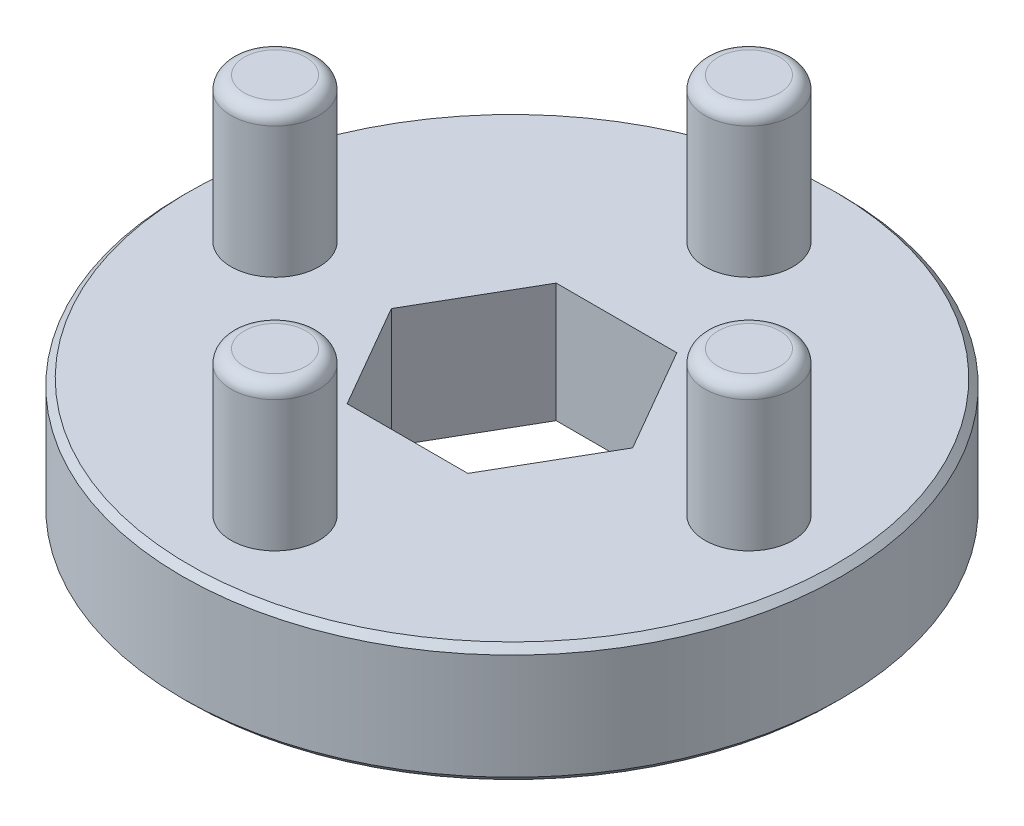
ISO-10303-21;
HEADER;
FILE_DESCRIPTION(('STEP AP214'),'2;1');
FILE_NAME('part.step','',(''),(''),'','','');
FILE_SCHEMA(('AUTOMOTIVE_DESIGN { 1 0 10303 214 1 1 1 1 }'));
ENDSEC;
DATA;
#1=APPLICATION_CONTEXT('core data for automotive mechanical design processes');
#2=APPLICATION_PROTOCOL_DEFINITION('international standard','automotive_design',2000,#1);
#3=PRODUCT_CONTEXT('',#1,'mechanical');
#4=PRODUCT('Part','Part','',(#3));
#5=PRODUCT_RELATED_PRODUCT_CATEGORY('part','',(#4));
#6=PRODUCT_DEFINITION_FORMATION('','',#4);
#7=PRODUCT_DEFINITION_CONTEXT('part definition',#1,'design');
#8=PRODUCT_DEFINITION('design','',#6,#7);
#9=PRODUCT_DEFINITION_SHAPE('','',#8);
#10=(LENGTH_UNIT() NAMED_UNIT(*) SI_UNIT(.MILLI.,.METRE.));
#11=(NAMED_UNIT(*) PLANE_ANGLE_UNIT() SI_UNIT($,.RADIAN.));
#12=(NAMED_UNIT(*) SI_UNIT($,.STERADIAN.) SOLID_ANGLE_UNIT());
#13=UNCERTAINTY_MEASURE_WITH_UNIT(LENGTH_MEASURE(1.E-05),#10,'distance_accuracy_value','');
#14=(GEOMETRIC_REPRESENTATION_CONTEXT(3) GLOBAL_UNCERTAINTY_ASSIGNED_CONTEXT((#13)) GLOBAL_UNIT_ASSIGNED_CONTEXT((#10,
#11,#12)) REPRESENTATION_CONTEXT('',''));
#15=CARTESIAN_POINT('',(0.,0.,0.));
#16=DIRECTION('',(0.,0.,1.));
#17=DIRECTION('',(1.,0.,0.));
#18=AXIS2_PLACEMENT_3D('',#15,#16,#17);
#19=CARTESIAN_POINT('',(-9.,10.000000066,0.));
#20=DIRECTION('',(0.,1.,0.));
#21=DIRECTION('',(0.,0.,1.));
#22=AXIS2_PLACEMENT_3D('',#19,#20,#21);
#23=PLANE('',#22);
#24=CARTESIAN_POINT('',(-9.,10.000000066,0.));
#25=DIRECTION('',(0.,-1.,0.));
#26=DIRECTION('',(0.,0.,-1.));
#27=AXIS2_PLACEMENT_3D('',#24,#25,#26);
#28=CIRCLE('',#27,1.17);
#29=CARTESIAN_POINT('',(-9.,10.000000066,-1.17000000000009));
#30=VERTEX_POINT('',#29);
#31=CARTESIAN_POINT('',(-9.,10.000000066,1.16999999999991));
#32=VERTEX_POINT('',#31);
#33=EDGE_CURVE('E94',#30,#32,#28,.T.);
#34=ORIENTED_EDGE('',*,*,#33,.F.);
#35=CARTESIAN_POINT('',(-9.,10.000000066,0.));
#36=DIRECTION('',(0.,-1.,0.));
#37=DIRECTION('',(0.,0.,1.));
#38=AXIS2_PLACEMENT_3D('',#35,#36,#37);
#39=CIRCLE('',#38,1.17);
#40=EDGE_CURVE('E92',#32,#30,#39,.T.);
#41=ORIENTED_EDGE('',*,*,#40,.F.);
#42=EDGE_LOOP('',(#34,#41));
#43=FACE_BOUND('',#42,.T.);
#44=ADVANCED_FACE('F16',(#43),#23,.T.);
#45=CARTESIAN_POINT('',(0.,10.000000066,9.));
#46=DIRECTION('',(0.,1.,0.));
#47=DIRECTION('',(0.,0.,1.));
#48=AXIS2_PLACEMENT_3D('',#45,#46,#47);
#49=PLANE('',#48);
#50=CARTESIAN_POINT('',(0.,10.000000066,9.));
#51=DIRECTION('',(0.,-1.,0.));
#52=DIRECTION('',(0.,0.,-1.));
#53=AXIS2_PLACEMENT_3D('',#50,#51,#52);
#54=CIRCLE('',#53,1.17);
#55=CARTESIAN_POINT('',(0.,10.000000066,7.83));
#56=VERTEX_POINT('',#55);
#57=CARTESIAN_POINT('',(0.,10.000000066,10.17));
#58=VERTEX_POINT('',#57);
#59=EDGE_CURVE('E338',#56,#58,#54,.T.);
#60=ORIENTED_EDGE('',*,*,#59,.F.);
#61=CARTESIAN_POINT('',(0.,10.000000066,9.));
#62=DIRECTION('',(0.,-1.,0.));
#63=DIRECTION('',(0.,0.,1.));
#64=AXIS2_PLACEMENT_3D('',#61,#62,#63);
#65=CIRCLE('',#64,1.17);
#66=EDGE_CURVE('E100',#58,#56,#65,.T.);
#67=ORIENTED_EDGE('',*,*,#66,.F.);
#68=EDGE_LOOP('',(#60,#67));
#69=FACE_BOUND('',#68,.T.);
#70=ADVANCED_FACE('F342',(#69),#49,.T.);
#71=CARTESIAN_POINT('',(9.,10.000000066,0.));
#72=DIRECTION('',(0.,1.,0.));
#73=DIRECTION('',(0.,0.,1.));
#74=AXIS2_PLACEMENT_3D('',#71,#72,#73);
#75=PLANE('',#74);
#76=CARTESIAN_POINT('',(9.,10.000000066,0.));
#77=DIRECTION('',(0.,-1.,0.));
#78=DIRECTION('',(0.,0.,-1.));
#79=AXIS2_PLACEMENT_3D('',#76,#77,#78);
#80=CIRCLE('',#79,1.17);
#81=CARTESIAN_POINT('',(9.,10.000000066,-1.16999999999997));
#82=VERTEX_POINT('',#81);
#83=CARTESIAN_POINT('',(9.,10.000000066,1.17000000000003));
#84=VERTEX_POINT('',#83);
#85=EDGE_CURVE('E515',#82,#84,#80,.T.);
#86=ORIENTED_EDGE('',*,*,#85,.F.);
#87=CARTESIAN_POINT('',(9.,10.000000066,0.));
#88=DIRECTION('',(0.,-1.,0.));
#89=DIRECTION('',(0.,0.,1.));
#90=AXIS2_PLACEMENT_3D('',#87,#88,#89);
#91=CIRCLE('',#90,1.17);
#92=EDGE_CURVE('E319',#84,#82,#91,.T.);
#93=ORIENTED_EDGE('',*,*,#92,.F.);
#94=EDGE_LOOP('',(#86,#93));
#95=FACE_BOUND('',#94,.T.);
#96=ADVANCED_FACE('F170',(#95),#75,.T.);
#97=CARTESIAN_POINT('',(0.,10.000000066,-9.));
#98=DIRECTION('',(0.,1.,0.));
#99=DIRECTION('',(0.,0.,1.));
#100=AXIS2_PLACEMENT_3D('',#97,#98,#99);
#101=PLANE('',#100);
#102=CARTESIAN_POINT('',(0.,10.000000066,-9.));
#103=DIRECTION('',(0.,-1.,0.));
#104=DIRECTION('',(0.,0.,-1.));
#105=AXIS2_PLACEMENT_3D('',#102,#103,#104);
#106=CIRCLE('',#105,1.17);
#107=CARTESIAN_POINT('',(0.,10.000000066,-10.17));
#108=VERTEX_POINT('',#107);
#109=CARTESIAN_POINT('',(0.,10.000000066,-7.83));
#110=VERTEX_POINT('',#109);
#111=EDGE_CURVE('E150',#108,#110,#106,.T.);
#112=ORIENTED_EDGE('',*,*,#111,.F.);
#113=CARTESIAN_POINT('',(0.,10.000000066,-9.));
#114=DIRECTION('',(0.,-1.,0.));
#115=DIRECTION('',(0.,0.,1.));
#116=AXIS2_PLACEMENT_3D('',#113,#114,#115);
#117=CIRCLE('',#116,1.17);
#118=EDGE_CURVE('E307',#110,#108,#117,.T.);
#119=ORIENTED_EDGE('',*,*,#118,.F.);
#120=EDGE_LOOP('',(#112,#119));
#121=FACE_BOUND('',#120,.T.);
#122=ADVANCED_FACE('F161',(#121),#101,.T.);
#123=CARTESIAN_POINT('',(-9.,9.500000066,0.));
#124=DIRECTION('',(0.,1.,0.));
#125=DIRECTION('',(0.,0.,1.));
#126=AXIS2_PLACEMENT_3D('',#123,#124,#125);
#127=TOROIDAL_SURFACE('',#126,1.17,0.5);
#128=ORIENTED_EDGE('',*,*,#40,.T.);
#129=ORIENTED_EDGE('',*,*,#33,.T.);
#130=EDGE_LOOP('',(#128,#129));
#131=FACE_BOUND('',#130,.T.);
#132=CARTESIAN_POINT('',(-9.,9.500000066,0.));
#133=DIRECTION('',(0.,-1.,0.));
#134=DIRECTION('',(0.,0.,-1.));
#135=AXIS2_PLACEMENT_3D('',#132,#133,#134);
#136=CIRCLE('',#135,1.67);
#137=CARTESIAN_POINT('',(-9.,9.500000066,-1.67000000000009));
#138=VERTEX_POINT('',#137);
#139=EDGE_CURVE('E148',#138,#138,#136,.T.);
#140=ORIENTED_EDGE('',*,*,#139,.F.);
#141=EDGE_LOOP('',(#140));
#142=FACE_BOUND('',#141,.T.);
#143=ADVANCED_FACE('F96',(#131,#142),#127,.T.);
#144=CARTESIAN_POINT('',(0.,9.500000066,9.));
#145=DIRECTION('',(0.,1.,0.));
#146=DIRECTION('',(0.,0.,1.));
#147=AXIS2_PLACEMENT_3D('',#144,#145,#146);
#148=TOROIDAL_SURFACE('',#147,1.17,0.5);
#149=ORIENTED_EDGE('',*,*,#66,.T.);
#150=ORIENTED_EDGE('',*,*,#59,.T.);
#151=EDGE_LOOP('',(#149,#150));
#152=FACE_BOUND('',#151,.T.);
#153=CARTESIAN_POINT('',(0.,9.500000066,9.));
#154=DIRECTION('',(0.,-1.,0.));
#155=DIRECTION('',(0.,0.,-1.));
#156=AXIS2_PLACEMENT_3D('',#153,#154,#155);
#157=CIRCLE('',#156,1.67);
#158=CARTESIAN_POINT('',(0.,9.500000066,7.33));
#159=VERTEX_POINT('',#158);
#160=EDGE_CURVE('E147',#159,#159,#157,.T.);
#161=ORIENTED_EDGE('',*,*,#160,.F.);
#162=EDGE_LOOP('',(#161));
#163=FACE_BOUND('',#162,.T.);
#164=ADVANCED_FACE('F125',(#152,#163),#148,.T.);
#165=CARTESIAN_POINT('',(9.,9.500000066,0.));
#166=DIRECTION('',(0.,1.,0.));
#167=DIRECTION('',(0.,0.,1.));
#168=AXIS2_PLACEMENT_3D('',#165,#166,#167);
#169=TOROIDAL_SURFACE('',#168,1.17,0.5);
#170=ORIENTED_EDGE('',*,*,#92,.T.);
#171=ORIENTED_EDGE('',*,*,#85,.T.);
#172=EDGE_LOOP('',(#170,#171));
#173=FACE_BOUND('',#172,.T.);
#174=CARTESIAN_POINT('',(9.,9.500000066,0.));
#175=DIRECTION('',(0.,-1.,0.));
#176=DIRECTION('',(0.,0.,-1.));
#177=AXIS2_PLACEMENT_3D('',#174,#175,#176);
#178=CIRCLE('',#177,1.67);
#179=CARTESIAN_POINT('',(9.,9.500000066,-1.66999999999997));
#180=VERTEX_POINT('',#179);
#181=EDGE_CURVE('E206',#180,#180,#178,.T.);
#182=ORIENTED_EDGE('',*,*,#181,.F.);
#183=EDGE_LOOP('',(#182));
#184=FACE_BOUND('',#183,.T.);
#185=ADVANCED_FACE('F135',(#173,#184),#169,.T.);
#186=CARTESIAN_POINT('',(0.,9.500000066,-9.));
#187=DIRECTION('',(0.,1.,0.));
#188=DIRECTION('',(0.,0.,1.));
#189=AXIS2_PLACEMENT_3D('',#186,#187,#188);
#190=TOROIDAL_SURFACE('',#189,1.17,0.5);
#191=ORIENTED_EDGE('',*,*,#118,.T.);
#192=ORIENTED_EDGE('',*,*,#111,.T.);
#193=EDGE_LOOP('',(#191,#192));
#194=FACE_BOUND('',#193,.T.);
#195=CARTESIAN_POINT('',(0.,9.500000066,-9.));
#196=DIRECTION('',(0.,-1.,0.));
#197=DIRECTION('',(0.,0.,-1.));
#198=AXIS2_PLACEMENT_3D('',#195,#196,#197);
#199=CIRCLE('',#198,1.67);
#200=CARTESIAN_POINT('',(0.,9.500000066,-10.67));
#201=VERTEX_POINT('',#200);
#202=EDGE_CURVE('E204',#201,#201,#199,.T.);
#203=ORIENTED_EDGE('',*,*,#202,.F.);
#204=EDGE_LOOP('',(#203));
#205=FACE_BOUND('',#204,.T.);
#206=ADVANCED_FACE('F188',(#194,#205),#190,.T.);
#207=CARTESIAN_POINT('',(-9.,10.000000066,0.));
#208=DIRECTION('',(0.,-1.,0.));
#209=DIRECTION('',(0.,0.,-1.));
#210=AXIS2_PLACEMENT_3D('',#207,#208,#209);
#211=CYLINDRICAL_SURFACE('',#210,1.67);
#212=CARTESIAN_POINT('',(-9.,4.52628,0.));
#213=DIRECTION('',(0.,-1.,0.));
#214=DIRECTION('',(0.,0.,-1.));
#215=AXIS2_PLACEMENT_3D('',#212,#213,#214);
#216=CIRCLE('',#215,1.67);
#217=CARTESIAN_POINT('',(-9.,4.52628,-1.67000000000009));
#218=VERTEX_POINT('',#217);
#219=EDGE_CURVE('E303',#218,#218,#216,.T.);
#220=ORIENTED_EDGE('',*,*,#219,.F.);
#221=EDGE_LOOP('',(#220));
#222=FACE_BOUND('',#221,.T.);
#223=ORIENTED_EDGE('',*,*,#139,.T.);
#224=EDGE_LOOP('',(#223));
#225=FACE_BOUND('',#224,.T.);
#226=ADVANCED_FACE('F198',(#222,#225),#211,.T.);
#227=CARTESIAN_POINT('',(0.,10.000000066,9.));
#228=DIRECTION('',(0.,-1.,0.));
#229=DIRECTION('',(0.,0.,-1.));
#230=AXIS2_PLACEMENT_3D('',#227,#228,#229);
#231=CYLINDRICAL_SURFACE('',#230,1.67);
#232=CARTESIAN_POINT('',(0.,4.52628,9.));
#233=DIRECTION('',(0.,-1.,0.));
#234=DIRECTION('',(0.,0.,-1.));
#235=AXIS2_PLACEMENT_3D('',#232,#233,#234);
#236=CIRCLE('',#235,1.67);
#237=CARTESIAN_POINT('',(0.,4.52628,7.33));
#238=VERTEX_POINT('',#237);
#239=EDGE_CURVE('E297',#238,#238,#236,.T.);
#240=ORIENTED_EDGE('',*,*,#239,.F.);
#241=EDGE_LOOP('',(#240));
#242=FACE_BOUND('',#241,.T.);
#243=ORIENTED_EDGE('',*,*,#160,.T.);
#244=EDGE_LOOP('',(#243));
#245=FACE_BOUND('',#244,.T.);
#246=ADVANCED_FACE('F216',(#242,#245),#231,.T.);
#247=CARTESIAN_POINT('',(9.,10.000000066,0.));
#248=DIRECTION('',(0.,-1.,0.));
#249=DIRECTION('',(0.,0.,-1.));
#250=AXIS2_PLACEMENT_3D('',#247,#248,#249);
#251=CYLINDRICAL_SURFACE('',#250,1.67);
#252=CARTESIAN_POINT('',(9.,4.52628,0.));
#253=DIRECTION('',(0.,-1.,0.));
#254=DIRECTION('',(0.,0.,-1.));
#255=AXIS2_PLACEMENT_3D('',#252,#253,#254);
#256=CIRCLE('',#255,1.67);
#257=CARTESIAN_POINT('',(9.,4.52628,-1.66999999999997));
#258=VERTEX_POINT('',#257);
#259=EDGE_CURVE('E291',#258,#258,#256,.T.);
#260=ORIENTED_EDGE('',*,*,#259,.F.);
#261=EDGE_LOOP('',(#260));
#262=FACE_BOUND('',#261,.T.);
#263=ORIENTED_EDGE('',*,*,#181,.T.);
#264=EDGE_LOOP('',(#263));
#265=FACE_BOUND('',#264,.T.);
#266=ADVANCED_FACE('F219',(#262,#265),#251,.T.);
#267=CARTESIAN_POINT('',(0.,10.000000066,-9.));
#268=DIRECTION('',(0.,-1.,0.));
#269=DIRECTION('',(0.,0.,-1.));
#270=AXIS2_PLACEMENT_3D('',#267,#268,#269);
#271=CYLINDRICAL_SURFACE('',#270,1.67);
#272=CARTESIAN_POINT('',(0.,4.52628,-9.));
#273=DIRECTION('',(0.,-1.,0.));
#274=DIRECTION('',(0.,0.,-1.));
#275=AXIS2_PLACEMENT_3D('',#272,#273,#274);
#276=CIRCLE('',#275,1.67);
#277=CARTESIAN_POINT('',(0.,4.52628,-10.67));
#278=VERTEX_POINT('',#277);
#279=EDGE_CURVE('E286',#278,#278,#276,.T.);
#280=ORIENTED_EDGE('',*,*,#279,.F.);
#281=EDGE_LOOP('',(#280));
#282=FACE_BOUND('',#281,.T.);
#283=ORIENTED_EDGE('',*,*,#202,.T.);
#284=EDGE_LOOP('',(#283));
#285=FACE_BOUND('',#284,.T.);
#286=ADVANCED_FACE('F226',(#282,#285),#271,.T.);
#287=CARTESIAN_POINT('',(0.,4.27227999999998,0.));
#288=DIRECTION('',(0.,-1.,0.));
#289=DIRECTION('',(0.,0.,-1.));
#290=AXIS2_PLACEMENT_3D('',#287,#288,#289);
#291=CONICAL_SURFACE('',#290,12.5222,0.785398163397452);
#292=CARTESIAN_POINT('',(0.,4.27227999999999,0.));
#293=DIRECTION('',(0.,-1.,0.));
#294=DIRECTION('',(0.,0.,-1.));
#295=AXIS2_PLACEMENT_3D('',#292,#293,#294);
#296=CIRCLE('',#295,12.5222);
#297=CARTESIAN_POINT('',(0.,4.27227999999999,-12.5222));
#298=VERTEX_POINT('',#297);
#299=EDGE_CURVE('E212',#298,#298,#296,.T.);
#300=ORIENTED_EDGE('',*,*,#299,.F.);
#301=EDGE_LOOP('',(#300));
#302=FACE_BOUND('',#301,.T.);
#303=CARTESIAN_POINT('',(0.,4.52628,0.));
#304=DIRECTION('',(0.,-1.,0.));
#305=DIRECTION('',(0.,0.,-1.));
#306=AXIS2_PLACEMENT_3D('',#303,#304,#305);
#307=CIRCLE('',#306,12.2682);
#308=CARTESIAN_POINT('',(0.,4.52628,-12.2682));
#309=VERTEX_POINT('',#308);
#310=EDGE_CURVE('E290',#309,#309,#307,.F.);
#311=ORIENTED_EDGE('',*,*,#310,.F.);
#312=EDGE_LOOP('',(#311));
#313=FACE_BOUND('',#312,.T.);
#314=ADVANCED_FACE('F274',(#302,#313),#291,.T.);
#315=CARTESIAN_POINT('',(0.,4.52628,0.));
#316=DIRECTION('',(0.,-1.,0.));
#317=DIRECTION('',(0.,0.,-1.));
#318=AXIS2_PLACEMENT_3D('',#315,#316,#317);
#319=CYLINDRICAL_SURFACE('',#318,12.5222);
#320=ORIENTED_EDGE('',*,*,#299,.T.);
#321=EDGE_LOOP('',(#320));
#322=FACE_BOUND('',#321,.T.);
#323=CARTESIAN_POINT('',(0.,0.254000000000001,0.));
#324=DIRECTION('',(0.,1.,0.));
#325=DIRECTION('',(0.,0.,1.));
#326=AXIS2_PLACEMENT_3D('',#323,#324,#325);
#327=CIRCLE('',#326,12.5222);
#328=CARTESIAN_POINT('',(0.,0.254000000000001,12.5222));
#329=VERTEX_POINT('',#328);
#330=EDGE_CURVE('E294',#329,#329,#327,.F.);
#331=ORIENTED_EDGE('',*,*,#330,.F.);
#332=EDGE_LOOP('',(#331));
#333=FACE_BOUND('',#332,.T.);
#334=ADVANCED_FACE('F270',(#322,#333),#319,.T.);
#335=CARTESIAN_POINT('',(0.,4.52628,0.));
#336=DIRECTION('',(0.,1.,0.));
#337=DIRECTION('',(0.,0.,1.));
#338=AXIS2_PLACEMENT_3D('',#335,#336,#337);
#339=PLANE('',#338);
#340=DIRECTION('',(0.5,0.,-0.866025403784439));
#341=VECTOR('',#340,1.);
#342=CARTESIAN_POINT('',(-2.29135888084633,4.52628,-3.96875));
#343=LINE('',#342,#341);
#344=CARTESIAN_POINT('',(-2.29135888084633,4.52628,-3.96875));
#345=VERTEX_POINT('',#344);
#346=CARTESIAN_POINT('',(-4.58271776169266,4.52628,0.));
#347=VERTEX_POINT('',#346);
#348=EDGE_CURVE('E550',#345,#347,#343,.F.);
#349=ORIENTED_EDGE('',*,*,#348,.F.);
#350=DIRECTION('',(1.,0.,0.));
#351=VECTOR('',#350,1.);
#352=CARTESIAN_POINT('',(2.29135888084633,4.52628,-3.96875));
#353=LINE('',#352,#351);
#354=CARTESIAN_POINT('',(2.29135888084633,4.52628,-3.96875));
#355=VERTEX_POINT('',#354);
#356=EDGE_CURVE('E554',#355,#345,#353,.F.);
#357=ORIENTED_EDGE('',*,*,#356,.F.);
#358=DIRECTION('',(0.5,0.,0.866025403784439));
#359=VECTOR('',#358,1.);
#360=CARTESIAN_POINT('',(4.58271776169266,4.52628,0.));
#361=LINE('',#360,#359);
#362=CARTESIAN_POINT('',(4.58271776169266,4.52628,0.));
#363=VERTEX_POINT('',#362);
#364=EDGE_CURVE('E558',#363,#355,#361,.F.);
#365=ORIENTED_EDGE('',*,*,#364,.F.);
#366=DIRECTION('',(-0.5,0.,0.866025403784439));
#367=VECTOR('',#366,1.);
#368=CARTESIAN_POINT('',(2.29135888084633,4.52628,3.96875));
#369=LINE('',#368,#367);
#370=CARTESIAN_POINT('',(2.29135888084633,4.52628,3.96875));
#371=VERTEX_POINT('',#370);
#372=EDGE_CURVE('E565',#371,#363,#369,.F.);
#373=ORIENTED_EDGE('',*,*,#372,.F.);
#374=DIRECTION('',(-1.,0.,0.));
#375=VECTOR('',#374,1.);
#376=CARTESIAN_POINT('',(-2.29135888084633,4.52628,3.96875));
#377=LINE('',#376,#375);
#378=CARTESIAN_POINT('',(-2.29135888084633,4.52628,3.96875));
#379=VERTEX_POINT('',#378);
#380=EDGE_CURVE('E544',#379,#371,#377,.F.);
#381=ORIENTED_EDGE('',*,*,#380,.F.);
#382=DIRECTION('',(-0.5,0.,-0.866025403784439));
#383=VECTOR('',#382,1.);
#384=CARTESIAN_POINT('',(-4.58271776169266,4.52628,0.));
#385=LINE('',#384,#383);
#386=EDGE_CURVE('E546',#347,#379,#385,.F.);
#387=ORIENTED_EDGE('',*,*,#386,.F.);
#388=EDGE_LOOP('',(#349,#357,#365,#373,#381,#387));
#389=FACE_BOUND('',#388,.T.);
#390=ORIENTED_EDGE('',*,*,#310,.T.);
#391=EDGE_LOOP('',(#390));
#392=FACE_BOUND('',#391,.T.);
#393=ORIENTED_EDGE('',*,*,#279,.T.);
#394=EDGE_LOOP('',(#393));
#395=FACE_BOUND('',#394,.T.);
#396=ORIENTED_EDGE('',*,*,#259,.T.);
#397=EDGE_LOOP('',(#396));
#398=FACE_BOUND('',#397,.T.);
#399=ORIENTED_EDGE('',*,*,#239,.T.);
#400=EDGE_LOOP('',(#399));
#401=FACE_BOUND('',#400,.T.);
#402=ORIENTED_EDGE('',*,*,#219,.T.);
#403=EDGE_LOOP('',(#402));
#404=FACE_BOUND('',#403,.T.);
#405=ADVANCED_FACE('F266',(#389,#392,#395,#398,#401,#404),#339,.T.);
#406=CARTESIAN_POINT('',(0.,0.254000000000001,0.));
#407=DIRECTION('',(0.,1.,0.));
#408=DIRECTION('',(0.,0.,1.));
#409=AXIS2_PLACEMENT_3D('',#406,#407,#408);
#410=CONICAL_SURFACE('',#409,12.5222,0.785398163397444);
#411=CARTESIAN_POINT('',(0.,0.,0.));
#412=DIRECTION('',(0.,1.,0.));
#413=DIRECTION('',(0.,0.,1.));
#414=AXIS2_PLACEMENT_3D('',#411,#412,#413);
#415=CIRCLE('',#414,12.2682);
#416=CARTESIAN_POINT('',(0.,0.,12.2682));
#417=VERTEX_POINT('',#416);
#418=EDGE_CURVE('E568',#417,#417,#415,.T.);
#419=ORIENTED_EDGE('',*,*,#418,.T.);
#420=EDGE_LOOP('',(#419));
#421=FACE_BOUND('',#420,.T.);
#422=ORIENTED_EDGE('',*,*,#330,.T.);
#423=EDGE_LOOP('',(#422));
#424=FACE_BOUND('',#423,.T.);
#425=ADVANCED_FACE('F262',(#421,#424),#410,.T.);
#426=CARTESIAN_POINT('',(-2.29135888084633,4.52628,3.96875));
#427=DIRECTION('',(0.,0.,-1.));
#428=DIRECTION('',(-1.,0.,0.));
#429=AXIS2_PLACEMENT_3D('',#426,#427,#428);
#430=PLANE('',#429);
#431=ORIENTED_EDGE('',*,*,#380,.T.);
#432=DIRECTION('',(0.,1.,0.));
#433=VECTOR('',#432,1.);
#434=CARTESIAN_POINT('',(2.29135888084633,4.52628,3.96875));
#435=LINE('',#434,#433);
#436=CARTESIAN_POINT('',(2.29135888084633,0.,3.96875));
#437=VERTEX_POINT('',#436);
#438=EDGE_CURVE('E562',#437,#371,#435,.T.);
#439=ORIENTED_EDGE('',*,*,#438,.F.);
#440=DIRECTION('',(1.,0.,0.));
#441=VECTOR('',#440,1.);
#442=CARTESIAN_POINT('',(0.,0.,3.96875));
#443=LINE('',#442,#441);
#444=CARTESIAN_POINT('',(-2.29135888084633,0.,3.96875));
#445=VERTEX_POINT('',#444);
#446=EDGE_CURVE('E569',#437,#445,#443,.F.);
#447=ORIENTED_EDGE('',*,*,#446,.T.);
#448=DIRECTION('',(0.,1.,0.));
#449=VECTOR('',#448,1.);
#450=CARTESIAN_POINT('',(-2.29135888084633,4.52628,3.96875));
#451=LINE('',#450,#449);
#452=EDGE_CURVE('E548',#379,#445,#451,.F.);
#453=ORIENTED_EDGE('',*,*,#452,.F.);
#454=EDGE_LOOP('',(#431,#439,#447,#453));
#455=FACE_BOUND('',#454,.T.);
#456=ADVANCED_FACE('F258',(#455),#430,.T.);
#457=CARTESIAN_POINT('',(-4.58271776169266,4.52628,0.));
#458=DIRECTION('',(0.866025403784439,0.,-0.5));
#459=DIRECTION('',(-0.5,0.,-0.866025403784439));
#460=AXIS2_PLACEMENT_3D('',#457,#458,#459);
#461=PLANE('',#460);
#462=ORIENTED_EDGE('',*,*,#386,.T.);
#463=ORIENTED_EDGE('',*,*,#452,.T.);
#464=DIRECTION('',(-0.5,0.,-0.866025403784438));
#465=VECTOR('',#464,1.);
#466=CARTESIAN_POINT('',(-2.29135888084633,0.,3.96875));
#467=LINE('',#466,#465);
#468=CARTESIAN_POINT('',(-4.58271776169266,0.,0.));
#469=VERTEX_POINT('',#468);
#470=EDGE_CURVE('E572',#445,#469,#467,.T.);
#471=ORIENTED_EDGE('',*,*,#470,.T.);
#472=DIRECTION('',(0.,1.,0.));
#473=VECTOR('',#472,1.);
#474=CARTESIAN_POINT('',(-4.58271776169266,4.52628,0.));
#475=LINE('',#474,#473);
#476=EDGE_CURVE('E552',#347,#469,#475,.F.);
#477=ORIENTED_EDGE('',*,*,#476,.F.);
#478=EDGE_LOOP('',(#462,#463,#471,#477));
#479=FACE_BOUND('',#478,.T.);
#480=ADVANCED_FACE('F254',(#479),#461,.T.);
#481=CARTESIAN_POINT('',(-2.29135888084633,4.52628,-3.96875));
#482=DIRECTION('',(0.866025403784439,0.,0.5));
#483=DIRECTION('',(0.5,0.,-0.866025403784439));
#484=AXIS2_PLACEMENT_3D('',#481,#482,#483);
#485=PLANE('',#484);
#486=ORIENTED_EDGE('',*,*,#348,.T.);
#487=ORIENTED_EDGE('',*,*,#476,.T.);
#488=DIRECTION('',(0.5,0.,-0.866025403784438));
#489=VECTOR('',#488,1.);
#490=CARTESIAN_POINT('',(-4.58271776169266,0.,0.));
#491=LINE('',#490,#489);
#492=CARTESIAN_POINT('',(-2.29135888084633,0.,-3.96875));
#493=VERTEX_POINT('',#492);
#494=EDGE_CURVE('E575',#469,#493,#491,.T.);
#495=ORIENTED_EDGE('',*,*,#494,.T.);
#496=DIRECTION('',(0.,1.,0.));
#497=VECTOR('',#496,1.);
#498=CARTESIAN_POINT('',(-2.29135888084633,4.52628,-3.96875));
#499=LINE('',#498,#497);
#500=EDGE_CURVE('E556',#345,#493,#499,.F.);
#501=ORIENTED_EDGE('',*,*,#500,.F.);
#502=EDGE_LOOP('',(#486,#487,#495,#501));
#503=FACE_BOUND('',#502,.T.);
#504=ADVANCED_FACE('F250',(#503),#485,.T.);
#505=CARTESIAN_POINT('',(2.29135888084633,4.52628,-3.96875));
#506=DIRECTION('',(0.,0.,1.));
#507=DIRECTION('',(1.,0.,0.));
#508=AXIS2_PLACEMENT_3D('',#505,#506,#507);
#509=PLANE('',#508);
#510=ORIENTED_EDGE('',*,*,#356,.T.);
#511=ORIENTED_EDGE('',*,*,#500,.T.);
#512=DIRECTION('',(1.,0.,0.));
#513=VECTOR('',#512,1.);
#514=CARTESIAN_POINT('',(0.,0.,-3.96875));
#515=LINE('',#514,#513);
#516=CARTESIAN_POINT('',(2.29135888084633,0.,-3.96875));
#517=VERTEX_POINT('',#516);
#518=EDGE_CURVE('E578',#493,#517,#515,.T.);
#519=ORIENTED_EDGE('',*,*,#518,.T.);
#520=DIRECTION('',(0.,1.,0.));
#521=VECTOR('',#520,1.);
#522=CARTESIAN_POINT('',(2.29135888084633,4.52628,-3.96875));
#523=LINE('',#522,#521);
#524=EDGE_CURVE('E560',#355,#517,#523,.F.);
#525=ORIENTED_EDGE('',*,*,#524,.F.);
#526=EDGE_LOOP('',(#510,#511,#519,#525));
#527=FACE_BOUND('',#526,.T.);
#528=ADVANCED_FACE('F246',(#527),#509,.T.);
#529=CARTESIAN_POINT('',(4.58271776169266,4.52628,0.));
#530=DIRECTION('',(-0.866025403784439,0.,0.5));
#531=DIRECTION('',(0.5,0.,0.866025403784439));
#532=AXIS2_PLACEMENT_3D('',#529,#530,#531);
#533=PLANE('',#532);
#534=ORIENTED_EDGE('',*,*,#364,.T.);
#535=ORIENTED_EDGE('',*,*,#524,.T.);
#536=DIRECTION('',(0.5,0.,0.866025403784439));
#537=VECTOR('',#536,1.);
#538=CARTESIAN_POINT('',(2.29135888084633,0.,-3.96875));
#539=LINE('',#538,#537);
#540=CARTESIAN_POINT('',(4.58271776169266,0.,0.));
#541=VERTEX_POINT('',#540);
#542=EDGE_CURVE('E28',#517,#541,#539,.T.);
#543=ORIENTED_EDGE('',*,*,#542,.T.);
#544=DIRECTION('',(0.,1.,0.));
#545=VECTOR('',#544,1.);
#546=CARTESIAN_POINT('',(4.58271776169266,4.52628,0.));
#547=LINE('',#546,#545);
#548=EDGE_CURVE('E36',#363,#541,#547,.F.);
#549=ORIENTED_EDGE('',*,*,#548,.F.);
#550=EDGE_LOOP('',(#534,#535,#543,#549));
#551=FACE_BOUND('',#550,.T.);
#552=ADVANCED_FACE('F239',(#551),#533,.T.);
#553=CARTESIAN_POINT('',(2.29135888084633,4.52628,3.96875));
#554=DIRECTION('',(-0.866025403784439,0.,-0.5));
#555=DIRECTION('',(-0.5,0.,0.866025403784439));
#556=AXIS2_PLACEMENT_3D('',#553,#554,#555);
#557=PLANE('',#556);
#558=ORIENTED_EDGE('',*,*,#372,.T.);
#559=ORIENTED_EDGE('',*,*,#548,.T.);
#560=DIRECTION('',(-0.5,0.,0.866025403784439));
#561=VECTOR('',#560,1.);
#562=CARTESIAN_POINT('',(4.58271776169266,0.,0.));
#563=LINE('',#562,#561);
#564=EDGE_CURVE('E11',#541,#437,#563,.T.);
#565=ORIENTED_EDGE('',*,*,#564,.T.);
#566=ORIENTED_EDGE('',*,*,#438,.T.);
#567=EDGE_LOOP('',(#558,#559,#565,#566));
#568=FACE_BOUND('',#567,.T.);
#569=ADVANCED_FACE('F233',(#568),#557,.T.);
#570=CARTESIAN_POINT('',(0.,0.,0.));
#571=DIRECTION('',(0.,1.,0.));
#572=DIRECTION('',(0.,0.,1.));
#573=AXIS2_PLACEMENT_3D('',#570,#571,#572);
#574=PLANE('',#573);
#575=ORIENTED_EDGE('',*,*,#542,.F.);
#576=ORIENTED_EDGE('',*,*,#518,.F.);
#577=ORIENTED_EDGE('',*,*,#494,.F.);
#578=ORIENTED_EDGE('',*,*,#470,.F.);
#579=ORIENTED_EDGE('',*,*,#446,.F.);
#580=ORIENTED_EDGE('',*,*,#564,.F.);
#581=EDGE_LOOP('',(#575,#576,#577,#578,#579,#580));
#582=FACE_BOUND('',#581,.T.);
#583=ORIENTED_EDGE('',*,*,#418,.F.);
#584=EDGE_LOOP('',(#583));
#585=FACE_BOUND('',#584,.T.);
#586=ADVANCED_FACE('F231',(#582,#585),#574,.F.);
#587=CLOSED_SHELL('',(#44,#70,#96,#122,#143,#164,#185,#206,#226,#246,#266,#286,#314,#334,#405,
#425,#456,#480,#504,#528,#552,#569,#586));
#588=MANIFOLD_SOLID_BREP('B1',#587);
#589=ADVANCED_BREP_SHAPE_REPRESENTATION('',(#18,#588),#14);
#590=SHAPE_DEFINITION_REPRESENTATION(#9,#589);
ENDSEC;
END-ISO-10303-21;
